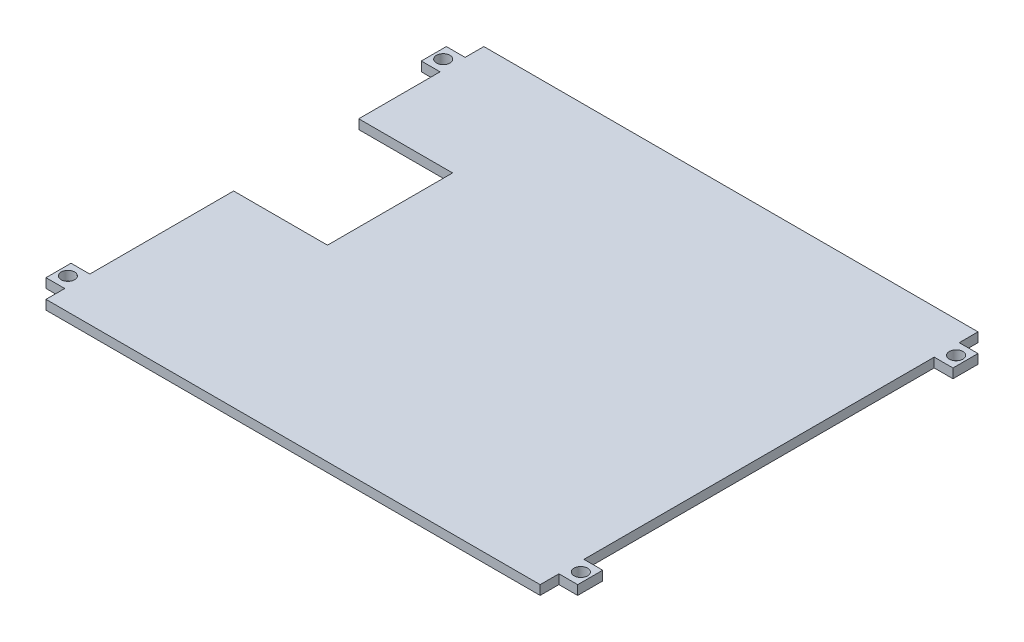
ISO-10303-21;
HEADER;
FILE_DESCRIPTION(('STEP AP214'),'2;1');
FILE_NAME('part.step','',(''),(''),'','','');
FILE_SCHEMA(('AUTOMOTIVE_DESIGN { 1 0 10303 214 1 1 1 1 }'));
ENDSEC;
DATA;
#1=APPLICATION_CONTEXT('core data for automotive mechanical design processes');
#2=APPLICATION_PROTOCOL_DEFINITION('international standard','automotive_design',2000,#1);
#3=PRODUCT_CONTEXT('',#1,'mechanical');
#4=PRODUCT('Part','Part','',(#3));
#5=PRODUCT_RELATED_PRODUCT_CATEGORY('part','',(#4));
#6=PRODUCT_DEFINITION_FORMATION('','',#4);
#7=PRODUCT_DEFINITION_CONTEXT('part definition',#1,'design');
#8=PRODUCT_DEFINITION('design','',#6,#7);
#9=PRODUCT_DEFINITION_SHAPE('','',#8);
#10=(LENGTH_UNIT() NAMED_UNIT(*) SI_UNIT(.MILLI.,.METRE.));
#11=(NAMED_UNIT(*) PLANE_ANGLE_UNIT() SI_UNIT($,.RADIAN.));
#12=(NAMED_UNIT(*) SI_UNIT($,.STERADIAN.) SOLID_ANGLE_UNIT());
#13=UNCERTAINTY_MEASURE_WITH_UNIT(LENGTH_MEASURE(1.E-05),#10,'distance_accuracy_value','');
#14=(GEOMETRIC_REPRESENTATION_CONTEXT(3) GLOBAL_UNCERTAINTY_ASSIGNED_CONTEXT((#13)) GLOBAL_UNIT_ASSIGNED_CONTEXT((#10,
#11,#12)) REPRESENTATION_CONTEXT('',''));
#15=CARTESIAN_POINT('',(0.,0.,0.));
#16=DIRECTION('',(0.,0.,1.));
#17=DIRECTION('',(1.,0.,0.));
#18=AXIS2_PLACEMENT_3D('',#15,#16,#17);
#19=CARTESIAN_POINT('',(-1.50000000000003,0.,-65.));
#20=DIRECTION('',(0.,1.,0.));
#21=DIRECTION('',(0.,0.,1.));
#22=AXIS2_PLACEMENT_3D('',#19,#20,#21);
#23=CYLINDRICAL_SURFACE('',#22,1.08);
#24=CARTESIAN_POINT('',(-1.50000000000003,0.,-65.));
#25=DIRECTION('',(0.,1.,0.));
#26=DIRECTION('',(0.,0.,1.));
#27=AXIS2_PLACEMENT_3D('',#24,#25,#26);
#28=CIRCLE('',#27,1.08);
#29=CARTESIAN_POINT('',(-1.50000000000003,0.,-63.92));
#30=VERTEX_POINT('',#29);
#31=EDGE_CURVE('E53',#30,#30,#28,.T.);
#32=ORIENTED_EDGE('',*,*,#31,.F.);
#33=EDGE_LOOP('',(#32));
#34=FACE_BOUND('',#33,.T.);
#35=CARTESIAN_POINT('',(-1.50000000000003,1.5,-65.));
#36=DIRECTION('',(0.,1.,0.));
#37=DIRECTION('',(0.,0.,1.));
#38=AXIS2_PLACEMENT_3D('',#35,#36,#37);
#39=CIRCLE('',#38,1.08);
#40=CARTESIAN_POINT('',(-1.50000000000003,1.5,-63.92));
#41=VERTEX_POINT('',#40);
#42=EDGE_CURVE('E11',#41,#41,#39,.T.);
#43=ORIENTED_EDGE('',*,*,#42,.T.);
#44=EDGE_LOOP('',(#43));
#45=FACE_BOUND('',#44,.T.);
#46=ADVANCED_FACE('F45',(#34,#45),#23,.F.);
#47=CARTESIAN_POINT('',(-1.5,0.,-5.));
#48=DIRECTION('',(0.,1.,0.));
#49=DIRECTION('',(0.,0.,1.));
#50=AXIS2_PLACEMENT_3D('',#47,#48,#49);
#51=CYLINDRICAL_SURFACE('',#50,1.08);
#52=CARTESIAN_POINT('',(-1.5,0.,-5.));
#53=DIRECTION('',(0.,1.,0.));
#54=DIRECTION('',(0.,0.,1.));
#55=AXIS2_PLACEMENT_3D('',#52,#53,#54);
#56=CIRCLE('',#55,1.08);
#57=CARTESIAN_POINT('',(-1.5,0.,-3.92000000000001));
#58=VERTEX_POINT('',#57);
#59=EDGE_CURVE('E447',#58,#58,#56,.T.);
#60=ORIENTED_EDGE('',*,*,#59,.F.);
#61=EDGE_LOOP('',(#60));
#62=FACE_BOUND('',#61,.T.);
#63=CARTESIAN_POINT('',(-1.5,1.5,-5.));
#64=DIRECTION('',(0.,1.,0.));
#65=DIRECTION('',(0.,0.,1.));
#66=AXIS2_PLACEMENT_3D('',#63,#64,#65);
#67=CIRCLE('',#66,1.08);
#68=CARTESIAN_POINT('',(-1.5,1.5,-3.92000000000001));
#69=VERTEX_POINT('',#68);
#70=EDGE_CURVE('E451',#69,#69,#67,.T.);
#71=ORIENTED_EDGE('',*,*,#70,.T.);
#72=EDGE_LOOP('',(#71));
#73=FACE_BOUND('',#72,.T.);
#74=ADVANCED_FACE('F461',(#62,#73),#51,.F.);
#75=CARTESIAN_POINT('',(79.,1.5,0.));
#76=DIRECTION('',(-1.,0.,0.));
#77=DIRECTION('',(0.,0.,1.));
#78=AXIS2_PLACEMENT_3D('',#75,#76,#77);
#79=PLANE('',#78);
#80=DIRECTION('',(0.,-1.,0.));
#81=VECTOR('',#80,1.);
#82=CARTESIAN_POINT('',(79.,1.5,-63.));
#83=LINE('',#82,#81);
#84=CARTESIAN_POINT('',(79.,1.5,-63.));
#85=VERTEX_POINT('',#84);
#86=CARTESIAN_POINT('',(79.,0.,-63.));
#87=VERTEX_POINT('',#86);
#88=EDGE_CURVE('E268',#85,#87,#83,.T.);
#89=ORIENTED_EDGE('',*,*,#88,.F.);
#90=DIRECTION('',(0.,0.,-1.));
#91=VECTOR('',#90,1.);
#92=CARTESIAN_POINT('',(79.,1.5,0.));
#93=LINE('',#92,#91);
#94=CARTESIAN_POINT('',(79.,1.5,-7.));
#95=VERTEX_POINT('',#94);
#96=EDGE_CURVE('E377',#95,#85,#93,.T.);
#97=ORIENTED_EDGE('',*,*,#96,.F.);
#98=DIRECTION('',(0.,1.,0.));
#99=VECTOR('',#98,1.);
#100=CARTESIAN_POINT('',(79.,1.5,-7.));
#101=LINE('',#100,#99);
#102=CARTESIAN_POINT('',(79.,0.,-7.));
#103=VERTEX_POINT('',#102);
#104=EDGE_CURVE('E334',#103,#95,#101,.T.);
#105=ORIENTED_EDGE('',*,*,#104,.F.);
#106=DIRECTION('',(0.,0.,-1.));
#107=VECTOR('',#106,1.);
#108=CARTESIAN_POINT('',(79.,0.,0.));
#109=LINE('',#108,#107);
#110=EDGE_CURVE('E401',#103,#87,#109,.T.);
#111=ORIENTED_EDGE('',*,*,#110,.T.);
#112=EDGE_LOOP('',(#89,#97,#105,#111));
#113=FACE_BOUND('',#112,.T.);
#114=ADVANCED_FACE('F506',(#113),#79,.F.);
#115=DIRECTION('',(0.,1.,0.));
#116=VECTOR('',#115,1.);
#117=CARTESIAN_POINT('',(79.,1.5,-67.));
#118=LINE('',#117,#116);
#119=CARTESIAN_POINT('',(79.,0.,-67.));
#120=VERTEX_POINT('',#119);
#121=CARTESIAN_POINT('',(79.,1.5,-67.));
#122=VERTEX_POINT('',#121);
#123=EDGE_CURVE('E258',#120,#122,#118,.T.);
#124=ORIENTED_EDGE('',*,*,#123,.F.);
#125=CARTESIAN_POINT('',(79.,0.,-70.));
#126=VERTEX_POINT('',#125);
#127=EDGE_CURVE('E396',#120,#126,#109,.T.);
#128=ORIENTED_EDGE('',*,*,#127,.T.);
#129=DIRECTION('',(0.,-1.,0.));
#130=VECTOR('',#129,1.);
#131=CARTESIAN_POINT('',(79.,1.5,-70.));
#132=LINE('',#131,#130);
#133=CARTESIAN_POINT('',(79.,1.5,-70.));
#134=VERTEX_POINT('',#133);
#135=EDGE_CURVE('E436',#134,#126,#132,.T.);
#136=ORIENTED_EDGE('',*,*,#135,.F.);
#137=EDGE_CURVE('E371',#122,#134,#93,.T.);
#138=ORIENTED_EDGE('',*,*,#137,.F.);
#139=EDGE_LOOP('',(#124,#128,#136,#138));
#140=FACE_BOUND('',#139,.T.);
#141=ADVANCED_FACE('F507',(#140),#79,.F.);
#142=CARTESIAN_POINT('',(0.,1.5,-30.));
#143=DIRECTION('',(1.,0.,0.));
#144=DIRECTION('',(0.,0.,-1.));
#145=AXIS2_PLACEMENT_3D('',#142,#143,#144);
#146=PLANE('',#145);
#147=DIRECTION('',(0.,-1.,0.));
#148=VECTOR('',#147,1.);
#149=CARTESIAN_POINT('',(0.,1.5,-3.));
#150=LINE('',#149,#148);
#151=CARTESIAN_POINT('',(0.,1.5,-3.));
#152=VERTEX_POINT('',#151);
#153=CARTESIAN_POINT('',(0.,0.,-3.));
#154=VERTEX_POINT('',#153);
#155=EDGE_CURVE('E226',#152,#154,#150,.T.);
#156=ORIENTED_EDGE('',*,*,#155,.T.);
#157=DIRECTION('',(0.,0.,1.));
#158=VECTOR('',#157,1.);
#159=CARTESIAN_POINT('',(0.,0.,-30.));
#160=LINE('',#159,#158);
#161=CARTESIAN_POINT('',(0.,0.,0.));
#162=VERTEX_POINT('',#161);
#163=EDGE_CURVE('E208',#154,#162,#160,.T.);
#164=ORIENTED_EDGE('',*,*,#163,.T.);
#165=DIRECTION('',(0.,-1.,0.));
#166=VECTOR('',#165,1.);
#167=CARTESIAN_POINT('',(0.,1.5,0.));
#168=LINE('',#167,#166);
#169=CARTESIAN_POINT('',(0.,1.5,0.));
#170=VERTEX_POINT('',#169);
#171=EDGE_CURVE('E444',#170,#162,#168,.T.);
#172=ORIENTED_EDGE('',*,*,#171,.F.);
#173=DIRECTION('',(0.,0.,1.));
#174=VECTOR('',#173,1.);
#175=CARTESIAN_POINT('',(0.,1.5,-30.));
#176=LINE('',#175,#174);
#177=EDGE_CURVE('E228',#152,#170,#176,.T.);
#178=ORIENTED_EDGE('',*,*,#177,.F.);
#179=EDGE_LOOP('',(#156,#164,#172,#178));
#180=FACE_BOUND('',#179,.T.);
#181=ADVANCED_FACE('F227',(#180),#146,.F.);
#182=DIRECTION('',(0.,1.,0.));
#183=VECTOR('',#182,1.);
#184=CARTESIAN_POINT('',(0.,1.5,-7.));
#185=LINE('',#184,#183);
#186=CARTESIAN_POINT('',(0.,0.,-7.));
#187=VERTEX_POINT('',#186);
#188=CARTESIAN_POINT('',(0.,1.5,-7.));
#189=VERTEX_POINT('',#188);
#190=EDGE_CURVE('E233',#187,#189,#185,.T.);
#191=ORIENTED_EDGE('',*,*,#190,.T.);
#192=CARTESIAN_POINT('',(0.,1.5,-30.));
#193=VERTEX_POINT('',#192);
#194=EDGE_CURVE('E364',#193,#189,#176,.T.);
#195=ORIENTED_EDGE('',*,*,#194,.F.);
#196=DIRECTION('',(0.,-1.,0.));
#197=VECTOR('',#196,1.);
#198=CARTESIAN_POINT('',(0.,1.5,-30.));
#199=LINE('',#198,#197);
#200=CARTESIAN_POINT('',(0.,0.,-30.));
#201=VERTEX_POINT('',#200);
#202=EDGE_CURVE('E391',#193,#201,#199,.T.);
#203=ORIENTED_EDGE('',*,*,#202,.T.);
#204=EDGE_CURVE('E222',#201,#187,#160,.T.);
#205=ORIENTED_EDGE('',*,*,#204,.T.);
#206=EDGE_LOOP('',(#191,#195,#203,#205));
#207=FACE_BOUND('',#206,.T.);
#208=ADVANCED_FACE('F497',(#207),#146,.F.);
#209=CARTESIAN_POINT('',(0.,1.5,-70.));
#210=DIRECTION('',(1.,0.,0.));
#211=DIRECTION('',(0.,0.,-1.));
#212=AXIS2_PLACEMENT_3D('',#209,#210,#211);
#213=PLANE('',#212);
#214=DIRECTION('',(0.,-1.,0.));
#215=VECTOR('',#214,1.);
#216=CARTESIAN_POINT('',(0.,1.5,-63.));
#217=LINE('',#216,#215);
#218=CARTESIAN_POINT('',(0.,1.5,-63.));
#219=VERTEX_POINT('',#218);
#220=CARTESIAN_POINT('',(0.,0.,-63.));
#221=VERTEX_POINT('',#220);
#222=EDGE_CURVE('E291',#219,#221,#217,.T.);
#223=ORIENTED_EDGE('',*,*,#222,.T.);
#224=DIRECTION('',(0.,0.,1.));
#225=VECTOR('',#224,1.);
#226=CARTESIAN_POINT('',(0.,0.,-70.));
#227=LINE('',#226,#225);
#228=CARTESIAN_POINT('',(0.,0.,-50.));
#229=VERTEX_POINT('',#228);
#230=EDGE_CURVE('E404',#221,#229,#227,.T.);
#231=ORIENTED_EDGE('',*,*,#230,.T.);
#232=DIRECTION('',(0.,-1.,0.));
#233=VECTOR('',#232,1.);
#234=CARTESIAN_POINT('',(0.,1.5,-50.));
#235=LINE('',#234,#233);
#236=CARTESIAN_POINT('',(0.,1.5,-50.));
#237=VERTEX_POINT('',#236);
#238=EDGE_CURVE('E428',#237,#229,#235,.T.);
#239=ORIENTED_EDGE('',*,*,#238,.F.);
#240=DIRECTION('',(0.,0.,1.));
#241=VECTOR('',#240,1.);
#242=CARTESIAN_POINT('',(0.,1.5,-70.));
#243=LINE('',#242,#241);
#244=EDGE_CURVE('E60',#219,#237,#243,.T.);
#245=ORIENTED_EDGE('',*,*,#244,.F.);
#246=EDGE_LOOP('',(#223,#231,#239,#245));
#247=FACE_BOUND('',#246,.T.);
#248=ADVANCED_FACE('F493',(#247),#213,.F.);
#249=DIRECTION('',(0.,1.,0.));
#250=VECTOR('',#249,1.);
#251=CARTESIAN_POINT('',(0.,1.5,-67.));
#252=LINE('',#251,#250);
#253=CARTESIAN_POINT('',(0.,0.,-67.));
#254=VERTEX_POINT('',#253);
#255=CARTESIAN_POINT('',(0.,1.5,-67.));
#256=VERTEX_POINT('',#255);
#257=EDGE_CURVE('E68',#254,#256,#252,.T.);
#258=ORIENTED_EDGE('',*,*,#257,.T.);
#259=CARTESIAN_POINT('',(0.,1.5,-70.));
#260=VERTEX_POINT('',#259);
#261=EDGE_CURVE('E380',#260,#256,#243,.T.);
#262=ORIENTED_EDGE('',*,*,#261,.F.);
#263=DIRECTION('',(0.,-1.,0.));
#264=VECTOR('',#263,1.);
#265=CARTESIAN_POINT('',(0.,1.5,-70.));
#266=LINE('',#265,#264);
#267=CARTESIAN_POINT('',(0.,0.,-70.));
#268=VERTEX_POINT('',#267);
#269=EDGE_CURVE('E432',#260,#268,#266,.T.);
#270=ORIENTED_EDGE('',*,*,#269,.T.);
#271=EDGE_CURVE('E405',#268,#254,#227,.T.);
#272=ORIENTED_EDGE('',*,*,#271,.T.);
#273=EDGE_LOOP('',(#258,#262,#270,#272));
#274=FACE_BOUND('',#273,.T.);
#275=ADVANCED_FACE('F496',(#274),#213,.F.);
#276=DIRECTION('',(0.,-1.,0.));
#277=VECTOR('',#276,1.);
#278=CARTESIAN_POINT('',(79.,1.5,-3.));
#279=LINE('',#278,#277);
#280=CARTESIAN_POINT('',(79.,1.5,-3.));
#281=VERTEX_POINT('',#280);
#282=CARTESIAN_POINT('',(79.,0.,-3.));
#283=VERTEX_POINT('',#282);
#284=EDGE_CURVE('E327',#281,#283,#279,.T.);
#285=ORIENTED_EDGE('',*,*,#284,.F.);
#286=CARTESIAN_POINT('',(79.,1.5,0.));
#287=VERTEX_POINT('',#286);
#288=EDGE_CURVE('E372',#287,#281,#93,.T.);
#289=ORIENTED_EDGE('',*,*,#288,.F.);
#290=DIRECTION('',(0.,-1.,0.));
#291=VECTOR('',#290,1.);
#292=CARTESIAN_POINT('',(79.,1.5,0.));
#293=LINE('',#292,#291);
#294=CARTESIAN_POINT('',(79.,0.,0.));
#295=VERTEX_POINT('',#294);
#296=EDGE_CURVE('E440',#287,#295,#293,.T.);
#297=ORIENTED_EDGE('',*,*,#296,.T.);
#298=EDGE_CURVE('E397',#295,#283,#109,.T.);
#299=ORIENTED_EDGE('',*,*,#298,.T.);
#300=EDGE_LOOP('',(#285,#289,#297,#299));
#301=FACE_BOUND('',#300,.T.);
#302=ADVANCED_FACE('F502',(#301),#79,.F.);
#303=CARTESIAN_POINT('',(0.,1.5,0.));
#304=DIRECTION('',(0.,0.,-1.));
#305=DIRECTION('',(-1.,0.,0.));
#306=AXIS2_PLACEMENT_3D('',#303,#304,#305);
#307=PLANE('',#306);
#308=DIRECTION('',(1.,0.,0.));
#309=VECTOR('',#308,1.);
#310=CARTESIAN_POINT('',(0.,0.,0.));
#311=LINE('',#310,#309);
#312=EDGE_CURVE('E217',#162,#295,#311,.T.);
#313=ORIENTED_EDGE('',*,*,#312,.T.);
#314=ORIENTED_EDGE('',*,*,#296,.F.);
#315=DIRECTION('',(1.,0.,0.));
#316=VECTOR('',#315,1.);
#317=CARTESIAN_POINT('',(0.,1.5,0.));
#318=LINE('',#317,#316);
#319=EDGE_CURVE('E368',#170,#287,#318,.T.);
#320=ORIENTED_EDGE('',*,*,#319,.F.);
#321=ORIENTED_EDGE('',*,*,#171,.T.);
#322=EDGE_LOOP('',(#313,#314,#320,#321));
#323=FACE_BOUND('',#322,.T.);
#324=ADVANCED_FACE('F500',(#323),#307,.F.);
#325=CARTESIAN_POINT('',(79.,1.5,-70.));
#326=DIRECTION('',(0.,0.,1.));
#327=DIRECTION('',(1.,0.,0.));
#328=AXIS2_PLACEMENT_3D('',#325,#326,#327);
#329=PLANE('',#328);
#330=DIRECTION('',(-1.,0.,0.));
#331=VECTOR('',#330,1.);
#332=CARTESIAN_POINT('',(79.,0.,-70.));
#333=LINE('',#332,#331);
#334=EDGE_CURVE('E400',#126,#268,#333,.T.);
#335=ORIENTED_EDGE('',*,*,#334,.T.);
#336=ORIENTED_EDGE('',*,*,#269,.F.);
#337=DIRECTION('',(-1.,0.,0.));
#338=VECTOR('',#337,1.);
#339=CARTESIAN_POINT('',(79.,1.5,-70.));
#340=LINE('',#339,#338);
#341=EDGE_CURVE('E376',#134,#260,#340,.T.);
#342=ORIENTED_EDGE('',*,*,#341,.F.);
#343=ORIENTED_EDGE('',*,*,#135,.T.);
#344=EDGE_LOOP('',(#335,#336,#342,#343));
#345=FACE_BOUND('',#344,.T.);
#346=ADVANCED_FACE('F491',(#345),#329,.F.);
#347=CARTESIAN_POINT('',(0.,1.5,-50.));
#348=DIRECTION('',(0.,0.,-1.));
#349=DIRECTION('',(-1.,0.,0.));
#350=AXIS2_PLACEMENT_3D('',#347,#348,#349);
#351=PLANE('',#350);
#352=DIRECTION('',(1.,0.,0.));
#353=VECTOR('',#352,1.);
#354=CARTESIAN_POINT('',(0.,0.,-50.));
#355=LINE('',#354,#353);
#356=CARTESIAN_POINT('',(15.,0.,-50.));
#357=VERTEX_POINT('',#356);
#358=EDGE_CURVE('E408',#229,#357,#355,.T.);
#359=ORIENTED_EDGE('',*,*,#358,.T.);
#360=DIRECTION('',(0.,-1.,0.));
#361=VECTOR('',#360,1.);
#362=CARTESIAN_POINT('',(15.,1.5,-50.));
#363=LINE('',#362,#361);
#364=CARTESIAN_POINT('',(15.,1.5,-50.));
#365=VERTEX_POINT('',#364);
#366=EDGE_CURVE('E424',#365,#357,#363,.T.);
#367=ORIENTED_EDGE('',*,*,#366,.F.);
#368=DIRECTION('',(1.,0.,0.));
#369=VECTOR('',#368,1.);
#370=CARTESIAN_POINT('',(0.,1.5,-50.));
#371=LINE('',#370,#369);
#372=EDGE_CURVE('E383',#237,#365,#371,.T.);
#373=ORIENTED_EDGE('',*,*,#372,.F.);
#374=ORIENTED_EDGE('',*,*,#238,.T.);
#375=EDGE_LOOP('',(#359,#367,#373,#374));
#376=FACE_BOUND('',#375,.T.);
#377=ADVANCED_FACE('F487',(#376),#351,.F.);
#378=CARTESIAN_POINT('',(15.,1.5,-50.));
#379=DIRECTION('',(1.,0.,0.));
#380=DIRECTION('',(0.,0.,-1.));
#381=AXIS2_PLACEMENT_3D('',#378,#379,#380);
#382=PLANE('',#381);
#383=DIRECTION('',(0.,0.,1.));
#384=VECTOR('',#383,1.);
#385=CARTESIAN_POINT('',(15.,0.,-50.));
#386=LINE('',#385,#384);
#387=CARTESIAN_POINT('',(15.,0.,-30.));
#388=VERTEX_POINT('',#387);
#389=EDGE_CURVE('E411',#357,#388,#386,.T.);
#390=ORIENTED_EDGE('',*,*,#389,.T.);
#391=DIRECTION('',(0.,-1.,0.));
#392=VECTOR('',#391,1.);
#393=CARTESIAN_POINT('',(15.,1.5,-30.));
#394=LINE('',#393,#392);
#395=CARTESIAN_POINT('',(15.,1.5,-30.));
#396=VERTEX_POINT('',#395);
#397=EDGE_CURVE('E420',#396,#388,#394,.T.);
#398=ORIENTED_EDGE('',*,*,#397,.F.);
#399=DIRECTION('',(0.,0.,1.));
#400=VECTOR('',#399,1.);
#401=CARTESIAN_POINT('',(15.,1.5,-50.));
#402=LINE('',#401,#400);
#403=EDGE_CURVE('E386',#365,#396,#402,.T.);
#404=ORIENTED_EDGE('',*,*,#403,.F.);
#405=ORIENTED_EDGE('',*,*,#366,.T.);
#406=EDGE_LOOP('',(#390,#398,#404,#405));
#407=FACE_BOUND('',#406,.T.);
#408=ADVANCED_FACE('F477',(#407),#382,.F.);
#409=CARTESIAN_POINT('',(15.,1.5,-30.));
#410=DIRECTION('',(0.,0.,1.));
#411=DIRECTION('',(1.,0.,0.));
#412=AXIS2_PLACEMENT_3D('',#409,#410,#411);
#413=PLANE('',#412);
#414=DIRECTION('',(-1.,0.,0.));
#415=VECTOR('',#414,1.);
#416=CARTESIAN_POINT('',(15.,0.,-30.));
#417=LINE('',#416,#415);
#418=EDGE_CURVE('E414',#388,#201,#417,.T.);
#419=ORIENTED_EDGE('',*,*,#418,.T.);
#420=ORIENTED_EDGE('',*,*,#202,.F.);
#421=DIRECTION('',(-1.,0.,0.));
#422=VECTOR('',#421,1.);
#423=CARTESIAN_POINT('',(15.,1.5,-30.));
#424=LINE('',#423,#422);
#425=EDGE_CURVE('E389',#396,#193,#424,.T.);
#426=ORIENTED_EDGE('',*,*,#425,.F.);
#427=ORIENTED_EDGE('',*,*,#397,.T.);
#428=EDGE_LOOP('',(#419,#420,#426,#427));
#429=FACE_BOUND('',#428,.T.);
#430=ADVANCED_FACE('F466',(#429),#413,.F.);
#431=CARTESIAN_POINT('',(0.,1.5,0.));
#432=DIRECTION('',(0.,1.,0.));
#433=DIRECTION('',(0.,0.,1.));
#434=AXIS2_PLACEMENT_3D('',#431,#432,#433);
#435=PLANE('',#434);
#436=CARTESIAN_POINT('',(80.5,1.5,-65.));
#437=DIRECTION('',(0.,1.,0.));
#438=DIRECTION('',(0.,0.,1.));
#439=AXIS2_PLACEMENT_3D('',#436,#437,#438);
#440=CIRCLE('',#439,1.08);
#441=CARTESIAN_POINT('',(80.5,1.5,-63.92));
#442=VERTEX_POINT('',#441);
#443=EDGE_CURVE('E303',#442,#442,#440,.T.);
#444=ORIENTED_EDGE('',*,*,#443,.F.);
#445=EDGE_LOOP('',(#444));
#446=FACE_BOUND('',#445,.T.);
#447=CARTESIAN_POINT('',(80.5,1.5,-5.));
#448=DIRECTION('',(0.,1.,0.));
#449=DIRECTION('',(0.,0.,1.));
#450=AXIS2_PLACEMENT_3D('',#447,#448,#449);
#451=CIRCLE('',#450,1.08);
#452=CARTESIAN_POINT('',(80.5,1.5,-3.92));
#453=VERTEX_POINT('',#452);
#454=EDGE_CURVE('E240',#453,#453,#451,.T.);
#455=ORIENTED_EDGE('',*,*,#454,.F.);
#456=EDGE_LOOP('',(#455));
#457=FACE_BOUND('',#456,.T.);
#458=ORIENTED_EDGE('',*,*,#194,.T.);
#459=DIRECTION('',(-1.,0.,0.));
#460=VECTOR('',#459,1.);
#461=CARTESIAN_POINT('',(0.,1.5,-7.));
#462=LINE('',#461,#460);
#463=CARTESIAN_POINT('',(-3.,1.5,-7.));
#464=VERTEX_POINT('',#463);
#465=EDGE_CURVE('E249',#189,#464,#462,.T.);
#466=ORIENTED_EDGE('',*,*,#465,.T.);
#467=DIRECTION('',(0.,0.,1.));
#468=VECTOR('',#467,1.);
#469=CARTESIAN_POINT('',(-3.,1.5,-3.));
#470=LINE('',#469,#468);
#471=CARTESIAN_POINT('',(-3.,1.5,-3.));
#472=VERTEX_POINT('',#471);
#473=EDGE_CURVE('E234',#464,#472,#470,.T.);
#474=ORIENTED_EDGE('',*,*,#473,.T.);
#475=DIRECTION('',(-1.,0.,0.));
#476=VECTOR('',#475,1.);
#477=CARTESIAN_POINT('',(0.,1.5,-3.));
#478=LINE('',#477,#476);
#479=EDGE_CURVE('E813',#152,#472,#478,.T.);
#480=ORIENTED_EDGE('',*,*,#479,.F.);
#481=ORIENTED_EDGE('',*,*,#177,.T.);
#482=ORIENTED_EDGE('',*,*,#319,.T.);
#483=ORIENTED_EDGE('',*,*,#288,.T.);
#484=DIRECTION('',(-1.,0.,0.));
#485=VECTOR('',#484,1.);
#486=CARTESIAN_POINT('',(82.,1.5,-3.));
#487=LINE('',#486,#485);
#488=CARTESIAN_POINT('',(82.,1.5,-3.));
#489=VERTEX_POINT('',#488);
#490=EDGE_CURVE('E343',#489,#281,#487,.T.);
#491=ORIENTED_EDGE('',*,*,#490,.F.);
#492=DIRECTION('',(0.,0.,1.));
#493=VECTOR('',#492,1.);
#494=CARTESIAN_POINT('',(82.,1.5,-3.));
#495=LINE('',#494,#493);
#496=CARTESIAN_POINT('',(82.,1.5,-7.));
#497=VERTEX_POINT('',#496);
#498=EDGE_CURVE('E340',#497,#489,#495,.T.);
#499=ORIENTED_EDGE('',*,*,#498,.F.);
#500=DIRECTION('',(-1.,0.,0.));
#501=VECTOR('',#500,1.);
#502=CARTESIAN_POINT('',(82.,1.5,-7.));
#503=LINE('',#502,#501);
#504=EDGE_CURVE('E353',#497,#95,#503,.T.);
#505=ORIENTED_EDGE('',*,*,#504,.T.);
#506=ORIENTED_EDGE('',*,*,#96,.T.);
#507=DIRECTION('',(-1.,0.,0.));
#508=VECTOR('',#507,1.);
#509=CARTESIAN_POINT('',(82.,1.5,-63.));
#510=LINE('',#509,#508);
#511=CARTESIAN_POINT('',(82.,1.5,-63.));
#512=VERTEX_POINT('',#511);
#513=EDGE_CURVE('E267',#512,#85,#510,.T.);
#514=ORIENTED_EDGE('',*,*,#513,.F.);
#515=DIRECTION('',(0.,0.,1.));
#516=VECTOR('',#515,1.);
#517=CARTESIAN_POINT('',(82.,1.5,-63.));
#518=LINE('',#517,#516);
#519=CARTESIAN_POINT('',(82.,1.5,-67.));
#520=VERTEX_POINT('',#519);
#521=EDGE_CURVE('E264',#520,#512,#518,.T.);
#522=ORIENTED_EDGE('',*,*,#521,.F.);
#523=DIRECTION('',(-1.,0.,0.));
#524=VECTOR('',#523,1.);
#525=CARTESIAN_POINT('',(82.,1.5,-67.));
#526=LINE('',#525,#524);
#527=EDGE_CURVE('E279',#520,#122,#526,.T.);
#528=ORIENTED_EDGE('',*,*,#527,.T.);
#529=ORIENTED_EDGE('',*,*,#137,.T.);
#530=ORIENTED_EDGE('',*,*,#341,.T.);
#531=ORIENTED_EDGE('',*,*,#261,.T.);
#532=DIRECTION('',(-1.,0.,0.));
#533=VECTOR('',#532,1.);
#534=CARTESIAN_POINT('',(0.,1.5,-67.));
#535=LINE('',#534,#533);
#536=CARTESIAN_POINT('',(-3.00000000000003,1.5,-67.));
#537=VERTEX_POINT('',#536);
#538=EDGE_CURVE('E314',#256,#537,#535,.T.);
#539=ORIENTED_EDGE('',*,*,#538,.T.);
#540=DIRECTION('',(0.,0.,1.));
#541=VECTOR('',#540,1.);
#542=CARTESIAN_POINT('',(-3.00000000000003,1.5,-63.));
#543=LINE('',#542,#541);
#544=CARTESIAN_POINT('',(-3.00000000000003,1.5,-63.));
#545=VERTEX_POINT('',#544);
#546=EDGE_CURVE('E294',#537,#545,#543,.T.);
#547=ORIENTED_EDGE('',*,*,#546,.T.);
#548=DIRECTION('',(-1.,0.,0.));
#549=VECTOR('',#548,1.);
#550=CARTESIAN_POINT('',(0.,1.5,-63.));
#551=LINE('',#550,#549);
#552=EDGE_CURVE('E297',#219,#545,#551,.T.);
#553=ORIENTED_EDGE('',*,*,#552,.F.);
#554=ORIENTED_EDGE('',*,*,#244,.T.);
#555=ORIENTED_EDGE('',*,*,#372,.T.);
#556=ORIENTED_EDGE('',*,*,#403,.T.);
#557=ORIENTED_EDGE('',*,*,#425,.T.);
#558=EDGE_LOOP('',(#458,#466,#474,#480,#481,#482,#483,#491,#499,#505,#506,#514,#522,#528,#529,
#530,#531,#539,#547,#553,#554,#555,#556,#557));
#559=FACE_BOUND('',#558,.T.);
#560=ORIENTED_EDGE('',*,*,#70,.F.);
#561=EDGE_LOOP('',(#560));
#562=FACE_BOUND('',#561,.T.);
#563=ORIENTED_EDGE('',*,*,#42,.F.);
#564=EDGE_LOOP('',(#563));
#565=FACE_BOUND('',#564,.T.);
#566=ADVANCED_FACE('F464',(#446,#457,#559,#562,#565),#435,.T.);
#567=CARTESIAN_POINT('',(0.,0.,0.));
#568=DIRECTION('',(0.,1.,0.));
#569=DIRECTION('',(0.,0.,1.));
#570=AXIS2_PLACEMENT_3D('',#567,#568,#569);
#571=PLANE('',#570);
#572=CARTESIAN_POINT('',(80.5,0.,-65.));
#573=DIRECTION('',(0.,1.,0.));
#574=DIRECTION('',(0.,0.,1.));
#575=AXIS2_PLACEMENT_3D('',#572,#573,#574);
#576=CIRCLE('',#575,1.08);
#577=CARTESIAN_POINT('',(80.5,0.,-63.92));
#578=VERTEX_POINT('',#577);
#579=EDGE_CURVE('E840',#578,#578,#576,.T.);
#580=ORIENTED_EDGE('',*,*,#579,.T.);
#581=EDGE_LOOP('',(#580));
#582=FACE_BOUND('',#581,.T.);
#583=CARTESIAN_POINT('',(80.5,0.,-5.));
#584=DIRECTION('',(0.,1.,0.));
#585=DIRECTION('',(0.,0.,1.));
#586=AXIS2_PLACEMENT_3D('',#583,#584,#585);
#587=CIRCLE('',#586,1.08);
#588=CARTESIAN_POINT('',(80.5,0.,-3.92));
#589=VERTEX_POINT('',#588);
#590=EDGE_CURVE('E246',#589,#589,#587,.T.);
#591=ORIENTED_EDGE('',*,*,#590,.T.);
#592=EDGE_LOOP('',(#591));
#593=FACE_BOUND('',#592,.T.);
#594=ORIENTED_EDGE('',*,*,#204,.F.);
#595=ORIENTED_EDGE('',*,*,#418,.F.);
#596=ORIENTED_EDGE('',*,*,#389,.F.);
#597=ORIENTED_EDGE('',*,*,#358,.F.);
#598=ORIENTED_EDGE('',*,*,#230,.F.);
#599=DIRECTION('',(-1.,0.,0.));
#600=VECTOR('',#599,1.);
#601=CARTESIAN_POINT('',(0.,0.,-63.));
#602=LINE('',#601,#600);
#603=CARTESIAN_POINT('',(-3.00000000000003,0.,-63.));
#604=VERTEX_POINT('',#603);
#605=EDGE_CURVE('E272',#221,#604,#602,.T.);
#606=ORIENTED_EDGE('',*,*,#605,.T.);
#607=DIRECTION('',(0.,0.,-1.));
#608=VECTOR('',#607,1.);
#609=CARTESIAN_POINT('',(-3.00000000000003,0.,-63.));
#610=LINE('',#609,#608);
#611=CARTESIAN_POINT('',(-3.00000000000003,0.,-67.));
#612=VERTEX_POINT('',#611);
#613=EDGE_CURVE('E302',#604,#612,#610,.T.);
#614=ORIENTED_EDGE('',*,*,#613,.T.);
#615=DIRECTION('',(-1.,0.,0.));
#616=VECTOR('',#615,1.);
#617=CARTESIAN_POINT('',(0.,0.,-67.));
#618=LINE('',#617,#616);
#619=EDGE_CURVE('E318',#254,#612,#618,.T.);
#620=ORIENTED_EDGE('',*,*,#619,.F.);
#621=ORIENTED_EDGE('',*,*,#271,.F.);
#622=ORIENTED_EDGE('',*,*,#334,.F.);
#623=ORIENTED_EDGE('',*,*,#127,.F.);
#624=DIRECTION('',(-1.,0.,0.));
#625=VECTOR('',#624,1.);
#626=CARTESIAN_POINT('',(82.,0.,-67.));
#627=LINE('',#626,#625);
#628=CARTESIAN_POINT('',(82.,0.,-67.));
#629=VERTEX_POINT('',#628);
#630=EDGE_CURVE('E283',#629,#120,#627,.T.);
#631=ORIENTED_EDGE('',*,*,#630,.F.);
#632=DIRECTION('',(0.,0.,-1.));
#633=VECTOR('',#632,1.);
#634=CARTESIAN_POINT('',(82.,0.,-63.));
#635=LINE('',#634,#633);
#636=CARTESIAN_POINT('',(82.,0.,-63.));
#637=VERTEX_POINT('',#636);
#638=EDGE_CURVE('E257',#637,#629,#635,.T.);
#639=ORIENTED_EDGE('',*,*,#638,.F.);
#640=DIRECTION('',(-1.,0.,0.));
#641=VECTOR('',#640,1.);
#642=CARTESIAN_POINT('',(82.,0.,-63.));
#643=LINE('',#642,#641);
#644=EDGE_CURVE('E287',#637,#87,#643,.T.);
#645=ORIENTED_EDGE('',*,*,#644,.T.);
#646=ORIENTED_EDGE('',*,*,#110,.F.);
#647=DIRECTION('',(-1.,0.,0.));
#648=VECTOR('',#647,1.);
#649=CARTESIAN_POINT('',(82.,0.,-7.));
#650=LINE('',#649,#648);
#651=CARTESIAN_POINT('',(82.,0.,-7.));
#652=VERTEX_POINT('',#651);
#653=EDGE_CURVE('E357',#652,#103,#650,.T.);
#654=ORIENTED_EDGE('',*,*,#653,.F.);
#655=DIRECTION('',(0.,0.,-1.));
#656=VECTOR('',#655,1.);
#657=CARTESIAN_POINT('',(82.,0.,-3.));
#658=LINE('',#657,#656);
#659=CARTESIAN_POINT('',(82.,0.,-3.));
#660=VERTEX_POINT('',#659);
#661=EDGE_CURVE('E333',#660,#652,#658,.T.);
#662=ORIENTED_EDGE('',*,*,#661,.F.);
#663=DIRECTION('',(-1.,0.,0.));
#664=VECTOR('',#663,1.);
#665=CARTESIAN_POINT('',(82.,0.,-3.));
#666=LINE('',#665,#664);
#667=EDGE_CURVE('E223',#660,#283,#666,.T.);
#668=ORIENTED_EDGE('',*,*,#667,.T.);
#669=ORIENTED_EDGE('',*,*,#298,.F.);
#670=ORIENTED_EDGE('',*,*,#312,.F.);
#671=ORIENTED_EDGE('',*,*,#163,.F.);
#672=DIRECTION('',(-1.,0.,0.));
#673=VECTOR('',#672,1.);
#674=CARTESIAN_POINT('',(0.,0.,-3.));
#675=LINE('',#674,#673);
#676=CARTESIAN_POINT('',(-3.,0.,-3.));
#677=VERTEX_POINT('',#676);
#678=EDGE_CURVE('E214',#154,#677,#675,.T.);
#679=ORIENTED_EDGE('',*,*,#678,.T.);
#680=DIRECTION('',(0.,0.,-1.));
#681=VECTOR('',#680,1.);
#682=CARTESIAN_POINT('',(-3.,0.,-3.));
#683=LINE('',#682,#681);
#684=CARTESIAN_POINT('',(-3.,0.,-7.));
#685=VERTEX_POINT('',#684);
#686=EDGE_CURVE('E821',#677,#685,#683,.T.);
#687=ORIENTED_EDGE('',*,*,#686,.T.);
#688=DIRECTION('',(-1.,0.,0.));
#689=VECTOR('',#688,1.);
#690=CARTESIAN_POINT('',(0.,0.,-7.));
#691=LINE('',#690,#689);
#692=EDGE_CURVE('E241',#187,#685,#691,.T.);
#693=ORIENTED_EDGE('',*,*,#692,.F.);
#694=EDGE_LOOP('',(#594,#595,#596,#597,#598,#606,#614,#620,#621,#622,#623,#631,#639,#645,#646,
#654,#662,#668,#669,#670,#671,#679,#687,#693));
#695=FACE_BOUND('',#694,.T.);
#696=ORIENTED_EDGE('',*,*,#59,.T.);
#697=EDGE_LOOP('',(#696));
#698=FACE_BOUND('',#697,.T.);
#699=ORIENTED_EDGE('',*,*,#31,.T.);
#700=EDGE_LOOP('',(#699));
#701=FACE_BOUND('',#700,.T.);
#702=ADVANCED_FACE('F211',(#582,#593,#695,#698,#701),#571,.F.);
#703=CARTESIAN_POINT('',(82.,1.5,-3.));
#704=DIRECTION('',(0.,0.,-1.));
#705=DIRECTION('',(-1.,0.,0.));
#706=AXIS2_PLACEMENT_3D('',#703,#704,#705);
#707=PLANE('',#706);
#708=ORIENTED_EDGE('',*,*,#284,.T.);
#709=ORIENTED_EDGE('',*,*,#667,.F.);
#710=DIRECTION('',(0.,-1.,0.));
#711=VECTOR('',#710,1.);
#712=CARTESIAN_POINT('',(82.,1.5,-3.));
#713=LINE('',#712,#711);
#714=EDGE_CURVE('E329',#489,#660,#713,.T.);
#715=ORIENTED_EDGE('',*,*,#714,.F.);
#716=ORIENTED_EDGE('',*,*,#490,.T.);
#717=EDGE_LOOP('',(#708,#709,#715,#716));
#718=FACE_BOUND('',#717,.T.);
#719=ADVANCED_FACE('F473',(#718),#707,.F.);
#720=CARTESIAN_POINT('',(82.,1.5,-7.));
#721=DIRECTION('',(0.,0.,1.));
#722=DIRECTION('',(0.,-1.,0.));
#723=AXIS2_PLACEMENT_3D('',#720,#721,#722);
#724=PLANE('',#723);
#725=ORIENTED_EDGE('',*,*,#104,.T.);
#726=ORIENTED_EDGE('',*,*,#504,.F.);
#727=DIRECTION('',(0.,1.,0.));
#728=VECTOR('',#727,1.);
#729=CARTESIAN_POINT('',(82.,1.5,-7.));
#730=LINE('',#729,#728);
#731=EDGE_CURVE('E337',#652,#497,#730,.T.);
#732=ORIENTED_EDGE('',*,*,#731,.F.);
#733=ORIENTED_EDGE('',*,*,#653,.T.);
#734=EDGE_LOOP('',(#725,#726,#732,#733));
#735=FACE_BOUND('',#734,.T.);
#736=ADVANCED_FACE('F597',(#735),#724,.F.);
#737=CARTESIAN_POINT('',(82.,0.,0.));
#738=DIRECTION('',(1.,0.,0.));
#739=DIRECTION('',(0.,0.,-1.));
#740=AXIS2_PLACEMENT_3D('',#737,#738,#739);
#741=PLANE('',#740);
#742=ORIENTED_EDGE('',*,*,#714,.T.);
#743=ORIENTED_EDGE('',*,*,#661,.T.);
#744=ORIENTED_EDGE('',*,*,#731,.T.);
#745=ORIENTED_EDGE('',*,*,#498,.T.);
#746=EDGE_LOOP('',(#742,#743,#744,#745));
#747=FACE_BOUND('',#746,.T.);
#748=ADVANCED_FACE('F594',(#747),#741,.T.);
#749=CARTESIAN_POINT('',(80.5,0.,-5.));
#750=DIRECTION('',(0.,1.,0.));
#751=DIRECTION('',(0.,0.,1.));
#752=AXIS2_PLACEMENT_3D('',#749,#750,#751);
#753=CYLINDRICAL_SURFACE('',#752,1.08);
#754=ORIENTED_EDGE('',*,*,#590,.F.);
#755=EDGE_LOOP('',(#754));
#756=FACE_BOUND('',#755,.T.);
#757=ORIENTED_EDGE('',*,*,#454,.T.);
#758=EDGE_LOOP('',(#757));
#759=FACE_BOUND('',#758,.T.);
#760=ADVANCED_FACE('F592',(#756,#759),#753,.F.);
#761=CARTESIAN_POINT('',(0.,1.5,-63.));
#762=DIRECTION('',(0.,0.,-1.));
#763=DIRECTION('',(-1.,0.,0.));
#764=AXIS2_PLACEMENT_3D('',#761,#762,#763);
#765=PLANE('',#764);
#766=DIRECTION('',(0.,-1.,0.));
#767=VECTOR('',#766,1.);
#768=CARTESIAN_POINT('',(-3.00000000000003,1.5,-63.));
#769=LINE('',#768,#767);
#770=EDGE_CURVE('E298',#545,#604,#769,.T.);
#771=ORIENTED_EDGE('',*,*,#770,.T.);
#772=ORIENTED_EDGE('',*,*,#605,.F.);
#773=ORIENTED_EDGE('',*,*,#222,.F.);
#774=ORIENTED_EDGE('',*,*,#552,.T.);
#775=EDGE_LOOP('',(#771,#772,#773,#774));
#776=FACE_BOUND('',#775,.T.);
#777=ADVANCED_FACE('F571',(#776),#765,.F.);
#778=CARTESIAN_POINT('',(0.,1.5,-67.));
#779=DIRECTION('',(0.,0.,1.));
#780=DIRECTION('',(0.,-1.,0.));
#781=AXIS2_PLACEMENT_3D('',#778,#779,#780);
#782=PLANE('',#781);
#783=DIRECTION('',(0.,1.,0.));
#784=VECTOR('',#783,1.);
#785=CARTESIAN_POINT('',(-3.00000000000003,1.5,-67.));
#786=LINE('',#785,#784);
#787=EDGE_CURVE('E306',#612,#537,#786,.T.);
#788=ORIENTED_EDGE('',*,*,#787,.T.);
#789=ORIENTED_EDGE('',*,*,#538,.F.);
#790=ORIENTED_EDGE('',*,*,#257,.F.);
#791=ORIENTED_EDGE('',*,*,#619,.T.);
#792=EDGE_LOOP('',(#788,#789,#790,#791));
#793=FACE_BOUND('',#792,.T.);
#794=ADVANCED_FACE('F577',(#793),#782,.F.);
#795=CARTESIAN_POINT('',(-3.00000000000003,0.,-60.));
#796=DIRECTION('',(1.,0.,0.));
#797=DIRECTION('',(0.,0.,-1.));
#798=AXIS2_PLACEMENT_3D('',#795,#796,#797);
#799=PLANE('',#798);
#800=ORIENTED_EDGE('',*,*,#770,.F.);
#801=ORIENTED_EDGE('',*,*,#546,.F.);
#802=ORIENTED_EDGE('',*,*,#787,.F.);
#803=ORIENTED_EDGE('',*,*,#613,.F.);
#804=EDGE_LOOP('',(#800,#801,#802,#803));
#805=FACE_BOUND('',#804,.T.);
#806=ADVANCED_FACE('F579',(#805),#799,.F.);
#807=CARTESIAN_POINT('',(82.,1.5,-63.));
#808=DIRECTION('',(0.,0.,-1.));
#809=DIRECTION('',(-1.,0.,0.));
#810=AXIS2_PLACEMENT_3D('',#807,#808,#809);
#811=PLANE('',#810);
#812=ORIENTED_EDGE('',*,*,#88,.T.);
#813=ORIENTED_EDGE('',*,*,#644,.F.);
#814=DIRECTION('',(0.,-1.,0.));
#815=VECTOR('',#814,1.);
#816=CARTESIAN_POINT('',(82.,1.5,-63.));
#817=LINE('',#816,#815);
#818=EDGE_CURVE('E253',#512,#637,#817,.T.);
#819=ORIENTED_EDGE('',*,*,#818,.F.);
#820=ORIENTED_EDGE('',*,*,#513,.T.);
#821=EDGE_LOOP('',(#812,#813,#819,#820));
#822=FACE_BOUND('',#821,.T.);
#823=ADVANCED_FACE('F537',(#822),#811,.F.);
#824=CARTESIAN_POINT('',(82.,1.5,-67.));
#825=DIRECTION('',(0.,0.,1.));
#826=DIRECTION('',(0.,-1.,0.));
#827=AXIS2_PLACEMENT_3D('',#824,#825,#826);
#828=PLANE('',#827);
#829=ORIENTED_EDGE('',*,*,#123,.T.);
#830=ORIENTED_EDGE('',*,*,#527,.F.);
#831=DIRECTION('',(0.,1.,0.));
#832=VECTOR('',#831,1.);
#833=CARTESIAN_POINT('',(82.,1.5,-67.));
#834=LINE('',#833,#832);
#835=EDGE_CURVE('E261',#629,#520,#834,.T.);
#836=ORIENTED_EDGE('',*,*,#835,.F.);
#837=ORIENTED_EDGE('',*,*,#630,.T.);
#838=EDGE_LOOP('',(#829,#830,#836,#837));
#839=FACE_BOUND('',#838,.T.);
#840=ADVANCED_FACE('F545',(#839),#828,.F.);
#841=CARTESIAN_POINT('',(82.,0.,-60.));
#842=DIRECTION('',(1.,0.,0.));
#843=DIRECTION('',(0.,0.,-1.));
#844=AXIS2_PLACEMENT_3D('',#841,#842,#843);
#845=PLANE('',#844);
#846=ORIENTED_EDGE('',*,*,#818,.T.);
#847=ORIENTED_EDGE('',*,*,#638,.T.);
#848=ORIENTED_EDGE('',*,*,#835,.T.);
#849=ORIENTED_EDGE('',*,*,#521,.T.);
#850=EDGE_LOOP('',(#846,#847,#848,#849));
#851=FACE_BOUND('',#850,.T.);
#852=ADVANCED_FACE('F539',(#851),#845,.T.);
#853=CARTESIAN_POINT('',(0.,1.5,-3.));
#854=DIRECTION('',(0.,0.,-1.));
#855=DIRECTION('',(-1.,0.,0.));
#856=AXIS2_PLACEMENT_3D('',#853,#854,#855);
#857=PLANE('',#856);
#858=DIRECTION('',(0.,-1.,0.));
#859=VECTOR('',#858,1.);
#860=CARTESIAN_POINT('',(-3.,1.5,-3.));
#861=LINE('',#860,#859);
#862=EDGE_CURVE('E238',#472,#677,#861,.T.);
#863=ORIENTED_EDGE('',*,*,#862,.T.);
#864=ORIENTED_EDGE('',*,*,#678,.F.);
#865=ORIENTED_EDGE('',*,*,#155,.F.);
#866=ORIENTED_EDGE('',*,*,#479,.T.);
#867=EDGE_LOOP('',(#863,#864,#865,#866));
#868=FACE_BOUND('',#867,.T.);
#869=ADVANCED_FACE('F236',(#868),#857,.F.);
#870=CARTESIAN_POINT('',(0.,1.5,-7.));
#871=DIRECTION('',(0.,0.,1.));
#872=DIRECTION('',(0.,-1.,0.));
#873=AXIS2_PLACEMENT_3D('',#870,#871,#872);
#874=PLANE('',#873);
#875=DIRECTION('',(0.,1.,0.));
#876=VECTOR('',#875,1.);
#877=CARTESIAN_POINT('',(-3.,1.5,-7.));
#878=LINE('',#877,#876);
#879=EDGE_CURVE('E824',#685,#464,#878,.T.);
#880=ORIENTED_EDGE('',*,*,#879,.T.);
#881=ORIENTED_EDGE('',*,*,#465,.F.);
#882=ORIENTED_EDGE('',*,*,#190,.F.);
#883=ORIENTED_EDGE('',*,*,#692,.T.);
#884=EDGE_LOOP('',(#880,#881,#882,#883));
#885=FACE_BOUND('',#884,.T.);
#886=ADVANCED_FACE('F661',(#885),#874,.F.);
#887=CARTESIAN_POINT('',(-3.,0.,0.));
#888=DIRECTION('',(1.,0.,0.));
#889=DIRECTION('',(0.,0.,-1.));
#890=AXIS2_PLACEMENT_3D('',#887,#888,#889);
#891=PLANE('',#890);
#892=ORIENTED_EDGE('',*,*,#862,.F.);
#893=ORIENTED_EDGE('',*,*,#473,.F.);
#894=ORIENTED_EDGE('',*,*,#879,.F.);
#895=ORIENTED_EDGE('',*,*,#686,.F.);
#896=EDGE_LOOP('',(#892,#893,#894,#895));
#897=FACE_BOUND('',#896,.T.);
#898=ADVANCED_FACE('F670',(#897),#891,.F.);
#899=CARTESIAN_POINT('',(80.5,0.,-65.));
#900=DIRECTION('',(0.,1.,0.));
#901=DIRECTION('',(0.,0.,1.));
#902=AXIS2_PLACEMENT_3D('',#899,#900,#901);
#903=CYLINDRICAL_SURFACE('',#902,1.08);
#904=ORIENTED_EDGE('',*,*,#579,.F.);
#905=EDGE_LOOP('',(#904));
#906=FACE_BOUND('',#905,.T.);
#907=ORIENTED_EDGE('',*,*,#443,.T.);
#908=EDGE_LOOP('',(#907));
#909=FACE_BOUND('',#908,.T.);
#910=ADVANCED_FACE('F680',(#906,#909),#903,.F.);
#911=CLOSED_SHELL('',(#46,#74,#114,#141,#181,#208,#248,#275,#302,#324,#346,#377,#408,#430,#566,
#702,#719,#736,#748,#760,#777,#794,#806,#823,#840,#852,#869,#886,#898,#910));
#912=MANIFOLD_SOLID_BREP('B2',#911);
#913=ADVANCED_BREP_SHAPE_REPRESENTATION('',(#18,#912),#14);
#914=SHAPE_DEFINITION_REPRESENTATION(#9,#913);
ENDSEC;
END-ISO-10303-21;
